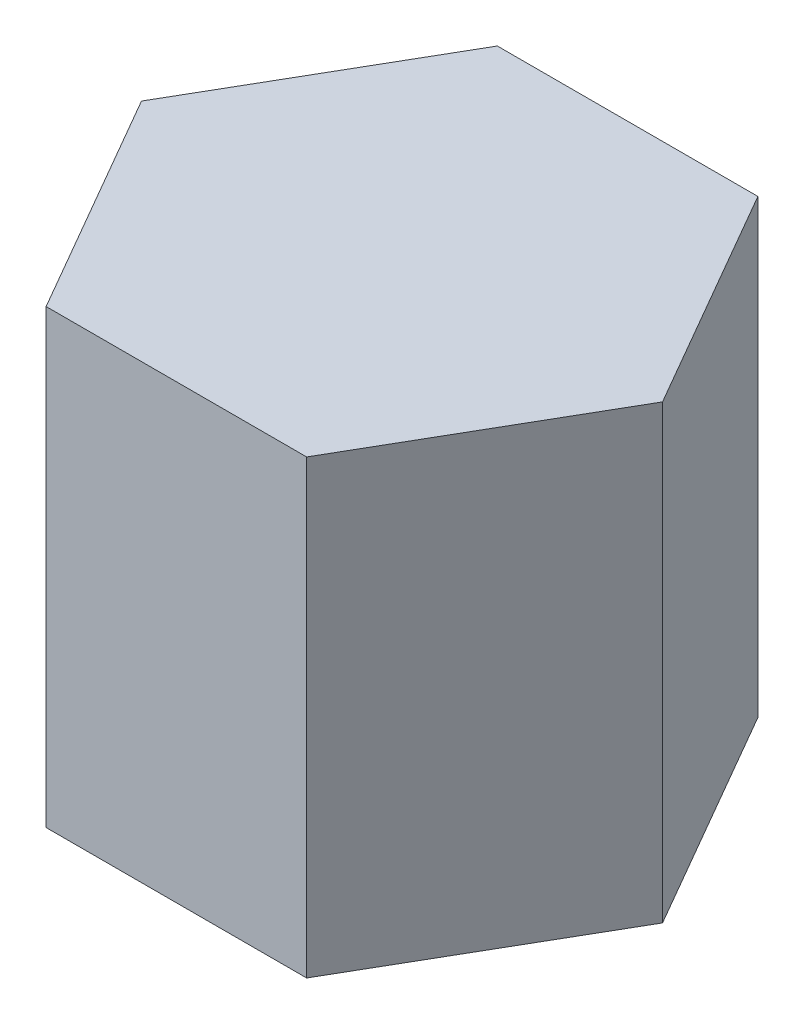
ISO-10303-21;
HEADER;
FILE_DESCRIPTION(('STEP AP214'),'2;1');
FILE_NAME('part.step','',(''),(''),'','','');
FILE_SCHEMA(('AUTOMOTIVE_DESIGN { 1 0 10303 214 1 1 1 1 }'));
ENDSEC;
DATA;
#1=APPLICATION_CONTEXT('core data for automotive mechanical design processes');
#2=APPLICATION_PROTOCOL_DEFINITION('international standard','automotive_design',2000,#1);
#3=PRODUCT_CONTEXT('',#1,'mechanical');
#4=PRODUCT('Part','Part','',(#3));
#5=PRODUCT_RELATED_PRODUCT_CATEGORY('part','',(#4));
#6=PRODUCT_DEFINITION_FORMATION('','',#4);
#7=PRODUCT_DEFINITION_CONTEXT('part definition',#1,'design');
#8=PRODUCT_DEFINITION('design','',#6,#7);
#9=PRODUCT_DEFINITION_SHAPE('','',#8);
#10=(LENGTH_UNIT() NAMED_UNIT(*) SI_UNIT(.MILLI.,.METRE.));
#11=(NAMED_UNIT(*) PLANE_ANGLE_UNIT() SI_UNIT($,.RADIAN.));
#12=(NAMED_UNIT(*) SI_UNIT($,.STERADIAN.) SOLID_ANGLE_UNIT());
#13=UNCERTAINTY_MEASURE_WITH_UNIT(LENGTH_MEASURE(1.E-05),#10,'distance_accuracy_value','');
#14=(GEOMETRIC_REPRESENTATION_CONTEXT(3) GLOBAL_UNCERTAINTY_ASSIGNED_CONTEXT((#13)) GLOBAL_UNIT_ASSIGNED_CONTEXT((#10,
#11,#12)) REPRESENTATION_CONTEXT('',''));
#15=CARTESIAN_POINT('',(0.,0.,0.));
#16=DIRECTION('',(0.,0.,1.));
#17=DIRECTION('',(1.,0.,0.));
#18=AXIS2_PLACEMENT_3D('',#15,#16,#17);
#19=CARTESIAN_POINT('',(14.4337567297407,50.,25.));
#20=DIRECTION('',(-0.866025403784439,0.,-0.499999999999999));
#21=DIRECTION('',(-0.499999999999999,0.,0.866025403784439));
#22=AXIS2_PLACEMENT_3D('',#19,#20,#21);
#23=PLANE('',#22);
#24=DIRECTION('',(0.499999999999999,0.,-0.866025403784439));
#25=VECTOR('',#24,1.);
#26=CARTESIAN_POINT('',(14.4337567297407,0.,25.));
#27=LINE('',#26,#25);
#28=CARTESIAN_POINT('',(14.4337567297407,0.,25.));
#29=VERTEX_POINT('',#28);
#30=CARTESIAN_POINT('',(28.8675134594813,0.,0.));
#31=VERTEX_POINT('',#30);
#32=EDGE_CURVE('E116',#29,#31,#27,.T.);
#33=ORIENTED_EDGE('',*,*,#32,.T.);
#34=DIRECTION('',(0.,-1.,0.));
#35=VECTOR('',#34,1.);
#36=CARTESIAN_POINT('',(28.8675134594813,50.,0.));
#37=LINE('',#36,#35);
#38=CARTESIAN_POINT('',(28.8675134594813,50.,0.));
#39=VERTEX_POINT('',#38);
#40=EDGE_CURVE('E11',#39,#31,#37,.T.);
#41=ORIENTED_EDGE('',*,*,#40,.F.);
#42=DIRECTION('',(0.499999999999999,0.,-0.866025403784439));
#43=VECTOR('',#42,1.);
#44=CARTESIAN_POINT('',(14.4337567297407,50.,25.));
#45=LINE('',#44,#43);
#46=CARTESIAN_POINT('',(14.4337567297407,50.,25.));
#47=VERTEX_POINT('',#46);
#48=EDGE_CURVE('E126',#47,#39,#45,.T.);
#49=ORIENTED_EDGE('',*,*,#48,.F.);
#50=DIRECTION('',(0.,-1.,0.));
#51=VECTOR('',#50,1.);
#52=CARTESIAN_POINT('',(14.4337567297407,50.,25.));
#53=LINE('',#52,#51);
#54=EDGE_CURVE('E112',#47,#29,#53,.T.);
#55=ORIENTED_EDGE('',*,*,#54,.T.);
#56=EDGE_LOOP('',(#33,#41,#49,#55));
#57=FACE_BOUND('',#56,.T.);
#58=ADVANCED_FACE('F32',(#57),#23,.F.);
#59=CARTESIAN_POINT('',(28.8675134594813,50.,0.));
#60=DIRECTION('',(-0.866025403784438,0.,0.5));
#61=DIRECTION('',(0.5,0.,0.866025403784438));
#62=AXIS2_PLACEMENT_3D('',#59,#60,#61);
#63=PLANE('',#62);
#64=DIRECTION('',(-0.5,0.,-0.866025403784438));
#65=VECTOR('',#64,1.);
#66=CARTESIAN_POINT('',(28.8675134594813,0.,0.));
#67=LINE('',#66,#65);
#68=CARTESIAN_POINT('',(14.4337567297406,0.,-25.));
#69=VERTEX_POINT('',#68);
#70=EDGE_CURVE('E119',#31,#69,#67,.T.);
#71=ORIENTED_EDGE('',*,*,#70,.T.);
#72=DIRECTION('',(0.,-1.,0.));
#73=VECTOR('',#72,1.);
#74=CARTESIAN_POINT('',(14.4337567297406,50.,-25.));
#75=LINE('',#74,#73);
#76=CARTESIAN_POINT('',(14.4337567297406,50.,-25.));
#77=VERTEX_POINT('',#76);
#78=EDGE_CURVE('E40',#77,#69,#75,.T.);
#79=ORIENTED_EDGE('',*,*,#78,.F.);
#80=DIRECTION('',(-0.5,0.,-0.866025403784438));
#81=VECTOR('',#80,1.);
#82=CARTESIAN_POINT('',(28.8675134594813,50.,0.));
#83=LINE('',#82,#81);
#84=EDGE_CURVE('E85',#39,#77,#83,.T.);
#85=ORIENTED_EDGE('',*,*,#84,.F.);
#86=ORIENTED_EDGE('',*,*,#40,.T.);
#87=EDGE_LOOP('',(#71,#79,#85,#86));
#88=FACE_BOUND('',#87,.T.);
#89=ADVANCED_FACE('F150',(#88),#63,.F.);
#90=CARTESIAN_POINT('',(14.4337567297406,50.,-25.));
#91=DIRECTION('',(0.,0.,1.));
#92=DIRECTION('',(1.,0.,0.));
#93=AXIS2_PLACEMENT_3D('',#90,#91,#92);
#94=PLANE('',#93);
#95=DIRECTION('',(-1.,0.,0.));
#96=VECTOR('',#95,1.);
#97=CARTESIAN_POINT('',(14.4337567297406,0.,-25.));
#98=LINE('',#97,#96);
#99=CARTESIAN_POINT('',(-14.4337567297407,0.,-25.));
#100=VERTEX_POINT('',#99);
#101=EDGE_CURVE('E121',#69,#100,#98,.T.);
#102=ORIENTED_EDGE('',*,*,#101,.T.);
#103=DIRECTION('',(0.,-1.,0.));
#104=VECTOR('',#103,1.);
#105=CARTESIAN_POINT('',(-14.4337567297407,50.,-25.));
#106=LINE('',#105,#104);
#107=CARTESIAN_POINT('',(-14.4337567297407,50.,-25.));
#108=VERTEX_POINT('',#107);
#109=EDGE_CURVE('E107',#108,#100,#106,.T.);
#110=ORIENTED_EDGE('',*,*,#109,.F.);
#111=DIRECTION('',(-1.,0.,0.));
#112=VECTOR('',#111,1.);
#113=CARTESIAN_POINT('',(14.4337567297406,50.,-25.));
#114=LINE('',#113,#112);
#115=EDGE_CURVE('E98',#77,#108,#114,.T.);
#116=ORIENTED_EDGE('',*,*,#115,.F.);
#117=ORIENTED_EDGE('',*,*,#78,.T.);
#118=EDGE_LOOP('',(#102,#110,#116,#117));
#119=FACE_BOUND('',#118,.T.);
#120=ADVANCED_FACE('F132',(#119),#94,.F.);
#121=CARTESIAN_POINT('',(-14.4337567297407,50.,-25.));
#122=DIRECTION('',(0.866025403784439,0.,0.499999999999999));
#123=DIRECTION('',(0.499999999999999,0.,-0.866025403784439));
#124=AXIS2_PLACEMENT_3D('',#121,#122,#123);
#125=PLANE('',#124);
#126=DIRECTION('',(-0.499999999999999,0.,0.866025403784439));
#127=VECTOR('',#126,1.);
#128=CARTESIAN_POINT('',(-14.4337567297407,0.,-25.));
#129=LINE('',#128,#127);
#130=CARTESIAN_POINT('',(-28.8675134594813,0.,0.));
#131=VERTEX_POINT('',#130);
#132=EDGE_CURVE('E106',#100,#131,#129,.T.);
#133=ORIENTED_EDGE('',*,*,#132,.T.);
#134=DIRECTION('',(0.,-1.,0.));
#135=VECTOR('',#134,1.);
#136=CARTESIAN_POINT('',(-28.8675134594813,50.,0.));
#137=LINE('',#136,#135);
#138=CARTESIAN_POINT('',(-28.8675134594813,50.,0.));
#139=VERTEX_POINT('',#138);
#140=EDGE_CURVE('E103',#139,#131,#137,.T.);
#141=ORIENTED_EDGE('',*,*,#140,.F.);
#142=DIRECTION('',(-0.499999999999999,0.,0.866025403784439));
#143=VECTOR('',#142,1.);
#144=CARTESIAN_POINT('',(-14.4337567297407,50.,-25.));
#145=LINE('',#144,#143);
#146=EDGE_CURVE('E92',#108,#139,#145,.T.);
#147=ORIENTED_EDGE('',*,*,#146,.F.);
#148=ORIENTED_EDGE('',*,*,#109,.T.);
#149=EDGE_LOOP('',(#133,#141,#147,#148));
#150=FACE_BOUND('',#149,.T.);
#151=ADVANCED_FACE('F104',(#150),#125,.F.);
#152=CARTESIAN_POINT('',(-28.8675134594813,50.,0.));
#153=DIRECTION('',(0.866025403784438,0.,-0.5));
#154=DIRECTION('',(-0.5,0.,-0.866025403784439));
#155=AXIS2_PLACEMENT_3D('',#152,#153,#154);
#156=PLANE('',#155);
#157=DIRECTION('',(0.5,0.,0.866025403784438));
#158=VECTOR('',#157,1.);
#159=CARTESIAN_POINT('',(-28.8675134594813,0.,0.));
#160=LINE('',#159,#158);
#161=CARTESIAN_POINT('',(-14.4337567297406,0.,25.));
#162=VERTEX_POINT('',#161);
#163=EDGE_CURVE('E71',#131,#162,#160,.T.);
#164=ORIENTED_EDGE('',*,*,#163,.T.);
#165=DIRECTION('',(0.,-1.,0.));
#166=VECTOR('',#165,1.);
#167=CARTESIAN_POINT('',(-14.4337567297406,50.,25.));
#168=LINE('',#167,#166);
#169=CARTESIAN_POINT('',(-14.4337567297406,50.,25.));
#170=VERTEX_POINT('',#169);
#171=EDGE_CURVE('E108',#170,#162,#168,.T.);
#172=ORIENTED_EDGE('',*,*,#171,.F.);
#173=DIRECTION('',(0.5,0.,0.866025403784438));
#174=VECTOR('',#173,1.);
#175=CARTESIAN_POINT('',(-28.8675134594813,50.,0.));
#176=LINE('',#175,#174);
#177=EDGE_CURVE('E96',#139,#170,#176,.T.);
#178=ORIENTED_EDGE('',*,*,#177,.F.);
#179=ORIENTED_EDGE('',*,*,#140,.T.);
#180=EDGE_LOOP('',(#164,#172,#178,#179));
#181=FACE_BOUND('',#180,.T.);
#182=ADVANCED_FACE('F110',(#181),#156,.F.);
#183=CARTESIAN_POINT('',(-14.4337567297406,50.,25.));
#184=DIRECTION('',(0.,0.,-1.));
#185=DIRECTION('',(-1.,0.,0.));
#186=AXIS2_PLACEMENT_3D('',#183,#184,#185);
#187=PLANE('',#186);
#188=DIRECTION('',(1.,0.,0.));
#189=VECTOR('',#188,1.);
#190=CARTESIAN_POINT('',(-14.4337567297406,0.,25.));
#191=LINE('',#190,#189);
#192=EDGE_CURVE('E77',#162,#29,#191,.T.);
#193=ORIENTED_EDGE('',*,*,#192,.T.);
#194=ORIENTED_EDGE('',*,*,#54,.F.);
#195=DIRECTION('',(1.,0.,0.));
#196=VECTOR('',#195,1.);
#197=CARTESIAN_POINT('',(-14.4337567297406,50.,25.));
#198=LINE('',#197,#196);
#199=EDGE_CURVE('E48',#170,#47,#198,.T.);
#200=ORIENTED_EDGE('',*,*,#199,.F.);
#201=ORIENTED_EDGE('',*,*,#171,.T.);
#202=EDGE_LOOP('',(#193,#194,#200,#201));
#203=FACE_BOUND('',#202,.T.);
#204=ADVANCED_FACE('F139',(#203),#187,.F.);
#205=CARTESIAN_POINT('',(0.,50.,0.));
#206=DIRECTION('',(0.,1.,0.));
#207=DIRECTION('',(0.,0.,1.));
#208=AXIS2_PLACEMENT_3D('',#205,#206,#207);
#209=PLANE('',#208);
#210=ORIENTED_EDGE('',*,*,#48,.T.);
#211=ORIENTED_EDGE('',*,*,#84,.T.);
#212=ORIENTED_EDGE('',*,*,#115,.T.);
#213=ORIENTED_EDGE('',*,*,#146,.T.);
#214=ORIENTED_EDGE('',*,*,#177,.T.);
#215=ORIENTED_EDGE('',*,*,#199,.T.);
#216=EDGE_LOOP('',(#210,#211,#212,#213,#214,#215));
#217=FACE_BOUND('',#216,.T.);
#218=ADVANCED_FACE('F94',(#217),#209,.T.);
#219=CARTESIAN_POINT('',(0.,0.,0.));
#220=DIRECTION('',(0.,1.,0.));
#221=DIRECTION('',(0.,0.,1.));
#222=AXIS2_PLACEMENT_3D('',#219,#220,#221);
#223=PLANE('',#222);
#224=ORIENTED_EDGE('',*,*,#32,.F.);
#225=ORIENTED_EDGE('',*,*,#192,.F.);
#226=ORIENTED_EDGE('',*,*,#163,.F.);
#227=ORIENTED_EDGE('',*,*,#132,.F.);
#228=ORIENTED_EDGE('',*,*,#101,.F.);
#229=ORIENTED_EDGE('',*,*,#70,.F.);
#230=EDGE_LOOP('',(#224,#225,#226,#227,#228,#229));
#231=FACE_BOUND('',#230,.T.);
#232=ADVANCED_FACE('F135',(#231),#223,.F.);
#233=CLOSED_SHELL('',(#58,#89,#120,#151,#182,#204,#218,#232));
#234=MANIFOLD_SOLID_BREP('B2',#233);
#235=ADVANCED_BREP_SHAPE_REPRESENTATION('',(#18,#234),#14);
#236=SHAPE_DEFINITION_REPRESENTATION(#9,#235);
ENDSEC;
END-ISO-10303-21;
